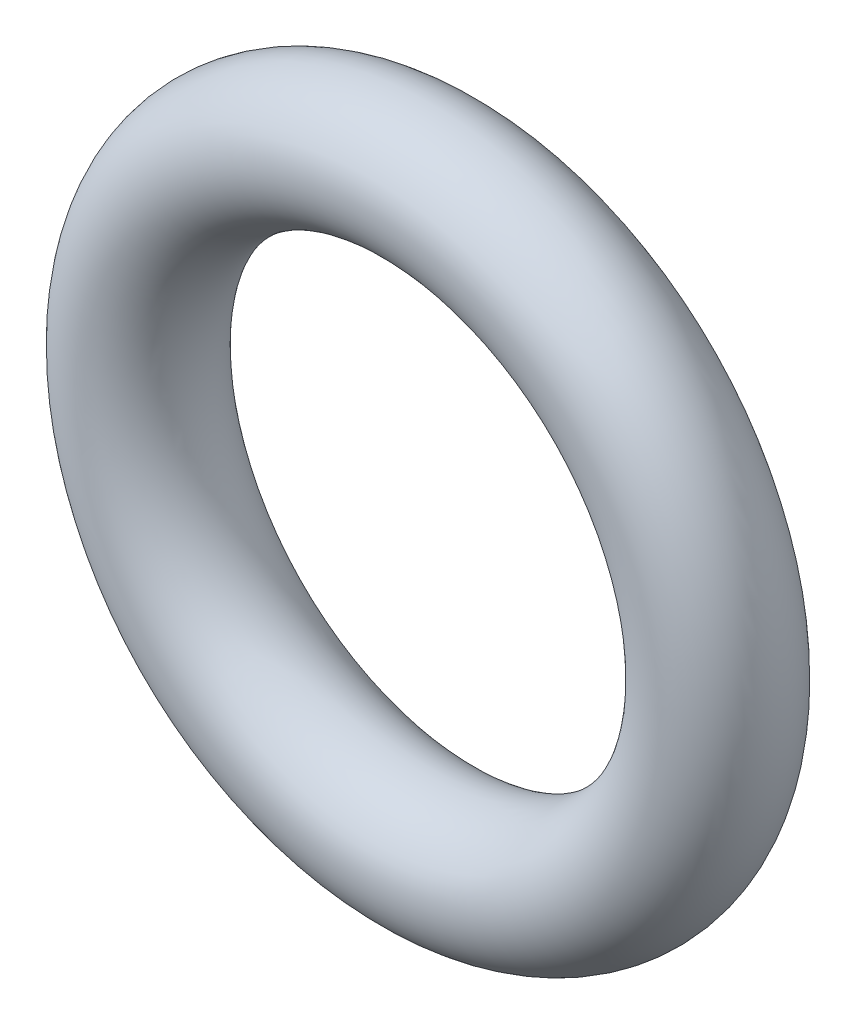
ISO-10303-21;
HEADER;
FILE_DESCRIPTION(('STEP AP214'),'2;1');
FILE_NAME('part.step','',(''),(''),'','','');
FILE_SCHEMA(('AUTOMOTIVE_DESIGN { 1 0 10303 214 1 1 1 1 }'));
ENDSEC;
DATA;
#1=APPLICATION_CONTEXT('core data for automotive mechanical design processes');
#2=APPLICATION_PROTOCOL_DEFINITION('international standard','automotive_design',2000,#1);
#3=PRODUCT_CONTEXT('',#1,'mechanical');
#4=PRODUCT('Part','Part','',(#3));
#5=PRODUCT_RELATED_PRODUCT_CATEGORY('part','',(#4));
#6=PRODUCT_DEFINITION_FORMATION('','',#4);
#7=PRODUCT_DEFINITION_CONTEXT('part definition',#1,'design');
#8=PRODUCT_DEFINITION('design','',#6,#7);
#9=PRODUCT_DEFINITION_SHAPE('','',#8);
#10=(LENGTH_UNIT() NAMED_UNIT(*) SI_UNIT(.MILLI.,.METRE.));
#11=(NAMED_UNIT(*) PLANE_ANGLE_UNIT() SI_UNIT($,.RADIAN.));
#12=(NAMED_UNIT(*) SI_UNIT($,.STERADIAN.) SOLID_ANGLE_UNIT());
#13=UNCERTAINTY_MEASURE_WITH_UNIT(LENGTH_MEASURE(1.E-05),#10,'distance_accuracy_value','');
#14=(GEOMETRIC_REPRESENTATION_CONTEXT(3) GLOBAL_UNCERTAINTY_ASSIGNED_CONTEXT((#13)) GLOBAL_UNIT_ASSIGNED_CONTEXT((#10,
#11,#12)) REPRESENTATION_CONTEXT('',''));
#15=CARTESIAN_POINT('',(0.,0.,0.));
#16=DIRECTION('',(0.,0.,1.));
#17=DIRECTION('',(1.,0.,0.));
#18=AXIS2_PLACEMENT_3D('',#15,#16,#17);
#19=CARTESIAN_POINT('',(0.,0.,0.));
#20=DIRECTION('',(0.,0.,1.));
#21=DIRECTION('',(1.,0.,0.));
#22=AXIS2_PLACEMENT_3D('',#19,#20,#21);
#23=TOROIDAL_SURFACE('',#22,11.8745,2.667);
#24=CARTESIAN_POINT('',(14.5415,0.,0.));
#25=VERTEX_POINT('',#24);
#26=VERTEX_LOOP('',#25);
#27=FACE_BOUND('',#26,.T.);
#28=ADVANCED_FACE('F12',(#27),#23,.T.);
#29=CLOSED_SHELL('',(#28));
#30=MANIFOLD_SOLID_BREP('B1',#29);
#31=ADVANCED_BREP_SHAPE_REPRESENTATION('',(#18,#30),#14);
#32=SHAPE_DEFINITION_REPRESENTATION(#9,#31);
ENDSEC;
END-ISO-10303-21;
